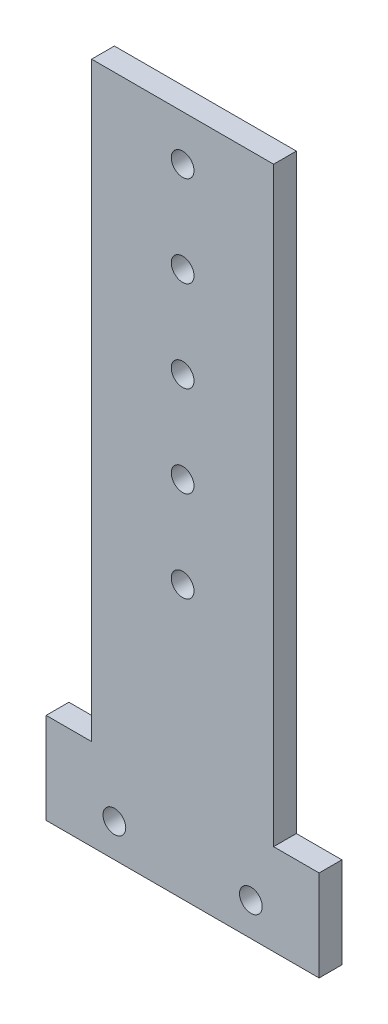
ISO-10303-21;
HEADER;
FILE_DESCRIPTION(('STEP AP214'),'2;1');
FILE_NAME('part.step','',(''),(''),'','','');
FILE_SCHEMA(('AUTOMOTIVE_DESIGN { 1 0 10303 214 1 1 1 1 }'));
ENDSEC;
DATA;
#1=APPLICATION_CONTEXT('core data for automotive mechanical design processes');
#2=APPLICATION_PROTOCOL_DEFINITION('international standard','automotive_design',2000,#1);
#3=PRODUCT_CONTEXT('',#1,'mechanical');
#4=PRODUCT('Part','Part','',(#3));
#5=PRODUCT_RELATED_PRODUCT_CATEGORY('part','',(#4));
#6=PRODUCT_DEFINITION_FORMATION('','',#4);
#7=PRODUCT_DEFINITION_CONTEXT('part definition',#1,'design');
#8=PRODUCT_DEFINITION('design','',#6,#7);
#9=PRODUCT_DEFINITION_SHAPE('','',#8);
#10=(LENGTH_UNIT() NAMED_UNIT(*) SI_UNIT(.MILLI.,.METRE.));
#11=(NAMED_UNIT(*) PLANE_ANGLE_UNIT() SI_UNIT($,.RADIAN.));
#12=(NAMED_UNIT(*) SI_UNIT($,.STERADIAN.) SOLID_ANGLE_UNIT());
#13=UNCERTAINTY_MEASURE_WITH_UNIT(LENGTH_MEASURE(1.E-05),#10,'distance_accuracy_value','');
#14=(GEOMETRIC_REPRESENTATION_CONTEXT(3) GLOBAL_UNCERTAINTY_ASSIGNED_CONTEXT((#13)) GLOBAL_UNIT_ASSIGNED_CONTEXT((#10,
#11,#12)) REPRESENTATION_CONTEXT('',''));
#15=CARTESIAN_POINT('',(0.,0.,0.));
#16=DIRECTION('',(0.,0.,1.));
#17=DIRECTION('',(1.,0.,0.));
#18=AXIS2_PLACEMENT_3D('',#15,#16,#17);
#19=CARTESIAN_POINT('',(0.,0.,6.35));
#20=DIRECTION('',(0.,0.,-1.));
#21=DIRECTION('',(-1.,0.,0.));
#22=AXIS2_PLACEMENT_3D('',#19,#20,#21);
#23=PLANE('',#22);
#24=DIRECTION('',(-1.,0.,0.));
#25=VECTOR('',#24,1.);
#26=CARTESIAN_POINT('',(50.8,178.506188544528,6.35));
#27=LINE('',#26,#25);
#28=CARTESIAN_POINT('',(50.8,178.506188544528,6.35));
#29=VERTEX_POINT('',#28);
#30=CARTESIAN_POINT('',(0.,178.506188544528,6.35));
#31=VERTEX_POINT('',#30);
#32=EDGE_CURVE('E145',#29,#31,#27,.T.);
#33=ORIENTED_EDGE('',*,*,#32,.T.);
#34=DIRECTION('',(0.,-1.,0.));
#35=VECTOR('',#34,1.);
#36=CARTESIAN_POINT('',(0.,13.5061885445277,6.35));
#37=LINE('',#36,#35);
#38=CARTESIAN_POINT('',(0.,13.5061885445277,6.35));
#39=VERTEX_POINT('',#38);
#40=EDGE_CURVE('E93',#31,#39,#37,.T.);
#41=ORIENTED_EDGE('',*,*,#40,.T.);
#42=DIRECTION('',(-1.,0.,0.));
#43=VECTOR('',#42,1.);
#44=CARTESIAN_POINT('',(0.,13.5061885445277,6.35));
#45=LINE('',#44,#43);
#46=CARTESIAN_POINT('',(-12.7,13.5061885445277,6.35));
#47=VERTEX_POINT('',#46);
#48=EDGE_CURVE('E160',#39,#47,#45,.T.);
#49=ORIENTED_EDGE('',*,*,#48,.T.);
#50=DIRECTION('',(0.,-1.,0.));
#51=VECTOR('',#50,1.);
#52=CARTESIAN_POINT('',(-12.7,13.5061885445277,6.35));
#53=LINE('',#52,#51);
#54=CARTESIAN_POINT('',(-12.7,-11.8938114554723,6.35));
#55=VERTEX_POINT('',#54);
#56=EDGE_CURVE('E173',#47,#55,#53,.T.);
#57=ORIENTED_EDGE('',*,*,#56,.T.);
#58=DIRECTION('',(1.,0.,0.));
#59=VECTOR('',#58,1.);
#60=CARTESIAN_POINT('',(63.5,-11.8938114554723,6.35));
#61=LINE('',#60,#59);
#62=CARTESIAN_POINT('',(63.5,-11.8938114554723,6.35));
#63=VERTEX_POINT('',#62);
#64=EDGE_CURVE('E112',#55,#63,#61,.T.);
#65=ORIENTED_EDGE('',*,*,#64,.T.);
#66=DIRECTION('',(0.,1.,0.));
#67=VECTOR('',#66,1.);
#68=CARTESIAN_POINT('',(63.5,13.5061885445277,6.35));
#69=LINE('',#68,#67);
#70=CARTESIAN_POINT('',(63.5,13.5061885445277,6.35));
#71=VERTEX_POINT('',#70);
#72=EDGE_CURVE('E106',#63,#71,#69,.T.);
#73=ORIENTED_EDGE('',*,*,#72,.T.);
#74=DIRECTION('',(-1.,0.,0.));
#75=VECTOR('',#74,1.);
#76=CARTESIAN_POINT('',(63.5,13.5061885445277,6.35));
#77=LINE('',#76,#75);
#78=CARTESIAN_POINT('',(50.8,13.5061885445277,6.35));
#79=VERTEX_POINT('',#78);
#80=EDGE_CURVE('E110',#71,#79,#77,.T.);
#81=ORIENTED_EDGE('',*,*,#80,.T.);
#82=DIRECTION('',(0.,1.,0.));
#83=VECTOR('',#82,1.);
#84=CARTESIAN_POINT('',(50.8,13.5061885445277,6.35));
#85=LINE('',#84,#83);
#86=EDGE_CURVE('E50',#79,#29,#85,.T.);
#87=ORIENTED_EDGE('',*,*,#86,.T.);
#88=EDGE_LOOP('',(#33,#41,#49,#57,#65,#73,#81,#87));
#89=FACE_BOUND('',#88,.T.);
#90=CARTESIAN_POINT('',(6.35,-2.60484772527531,6.35));
#91=DIRECTION('',(0.,0.,1.));
#92=DIRECTION('',(1.,0.,0.));
#93=AXIS2_PLACEMENT_3D('',#90,#91,#92);
#94=CIRCLE('',#93,3.175);
#95=CARTESIAN_POINT('',(9.525,-2.60484772527531,6.35));
#96=VERTEX_POINT('',#95);
#97=EDGE_CURVE('E134',#96,#96,#94,.T.);
#98=ORIENTED_EDGE('',*,*,#97,.F.);
#99=EDGE_LOOP('',(#98));
#100=FACE_BOUND('',#99,.T.);
#101=CARTESIAN_POINT('',(44.45,-2.60484772527531,6.35));
#102=DIRECTION('',(0.,0.,1.));
#103=DIRECTION('',(1.,0.,0.));
#104=AXIS2_PLACEMENT_3D('',#101,#102,#103);
#105=CIRCLE('',#104,3.175);
#106=CARTESIAN_POINT('',(47.625,-2.60484772527531,6.35));
#107=VERTEX_POINT('',#106);
#108=EDGE_CURVE('E182',#107,#107,#105,.T.);
#109=ORIENTED_EDGE('',*,*,#108,.F.);
#110=EDGE_LOOP('',(#109));
#111=FACE_BOUND('',#110,.T.);
#112=CARTESIAN_POINT('',(25.4,165.806188544528,6.35));
#113=DIRECTION('',(0.,0.,1.));
#114=DIRECTION('',(1.,0.,0.));
#115=AXIS2_PLACEMENT_3D('',#112,#113,#114);
#116=CIRCLE('',#115,3.175);
#117=CARTESIAN_POINT('',(28.575,165.806188544528,6.35));
#118=VERTEX_POINT('',#117);
#119=EDGE_CURVE('E188',#118,#118,#116,.T.);
#120=ORIENTED_EDGE('',*,*,#119,.F.);
#121=EDGE_LOOP('',(#120));
#122=FACE_BOUND('',#121,.T.);
#123=CARTESIAN_POINT('',(25.4,140.406188544528,6.35));
#124=DIRECTION('',(0.,0.,1.));
#125=DIRECTION('',(1.,0.,0.));
#126=AXIS2_PLACEMENT_3D('',#123,#124,#125);
#127=CIRCLE('',#126,3.175);
#128=CARTESIAN_POINT('',(28.575,140.406188544528,6.35));
#129=VERTEX_POINT('',#128);
#130=EDGE_CURVE('E194',#129,#129,#127,.T.);
#131=ORIENTED_EDGE('',*,*,#130,.F.);
#132=EDGE_LOOP('',(#131));
#133=FACE_BOUND('',#132,.T.);
#134=CARTESIAN_POINT('',(25.4,115.006188544528,6.35));
#135=DIRECTION('',(0.,0.,1.));
#136=DIRECTION('',(1.,0.,0.));
#137=AXIS2_PLACEMENT_3D('',#134,#135,#136);
#138=CIRCLE('',#137,3.175);
#139=CARTESIAN_POINT('',(28.575,115.006188544528,6.35));
#140=VERTEX_POINT('',#139);
#141=EDGE_CURVE('E200',#140,#140,#138,.T.);
#142=ORIENTED_EDGE('',*,*,#141,.F.);
#143=EDGE_LOOP('',(#142));
#144=FACE_BOUND('',#143,.T.);
#145=CARTESIAN_POINT('',(25.4,89.6061885445277,6.35));
#146=DIRECTION('',(0.,0.,1.));
#147=DIRECTION('',(1.,0.,0.));
#148=AXIS2_PLACEMENT_3D('',#145,#146,#147);
#149=CIRCLE('',#148,3.175);
#150=CARTESIAN_POINT('',(28.575,89.6061885445277,6.35));
#151=VERTEX_POINT('',#150);
#152=EDGE_CURVE('E206',#151,#151,#149,.T.);
#153=ORIENTED_EDGE('',*,*,#152,.F.);
#154=EDGE_LOOP('',(#153));
#155=FACE_BOUND('',#154,.T.);
#156=CARTESIAN_POINT('',(25.4,64.2061885445277,6.35));
#157=DIRECTION('',(0.,0.,1.));
#158=DIRECTION('',(1.,0.,0.));
#159=AXIS2_PLACEMENT_3D('',#156,#157,#158);
#160=CIRCLE('',#159,3.175);
#161=CARTESIAN_POINT('',(28.575,64.2061885445277,6.35));
#162=VERTEX_POINT('',#161);
#163=EDGE_CURVE('E212',#162,#162,#160,.T.);
#164=ORIENTED_EDGE('',*,*,#163,.F.);
#165=EDGE_LOOP('',(#164));
#166=FACE_BOUND('',#165,.T.);
#167=ADVANCED_FACE('F33',(#89,#100,#111,#122,#133,#144,#155,#166),#23,.F.);
#168=CARTESIAN_POINT('',(0.,0.,0.));
#169=DIRECTION('',(0.,0.,-1.));
#170=DIRECTION('',(-1.,0.,0.));
#171=AXIS2_PLACEMENT_3D('',#168,#169,#170);
#172=PLANE('',#171);
#173=CARTESIAN_POINT('',(25.4,89.6061885445277,0.));
#174=DIRECTION('',(0.,0.,1.));
#175=DIRECTION('',(1.,0.,0.));
#176=AXIS2_PLACEMENT_3D('',#173,#174,#175);
#177=CIRCLE('',#176,3.175);
#178=CARTESIAN_POINT('',(28.575,89.6061885445277,0.));
#179=VERTEX_POINT('',#178);
#180=EDGE_CURVE('E209',#179,#179,#177,.T.);
#181=ORIENTED_EDGE('',*,*,#180,.T.);
#182=EDGE_LOOP('',(#181));
#183=FACE_BOUND('',#182,.T.);
#184=CARTESIAN_POINT('',(25.4,140.406188544528,0.));
#185=DIRECTION('',(0.,0.,1.));
#186=DIRECTION('',(1.,0.,0.));
#187=AXIS2_PLACEMENT_3D('',#184,#185,#186);
#188=CIRCLE('',#187,3.175);
#189=CARTESIAN_POINT('',(28.575,140.406188544528,0.));
#190=VERTEX_POINT('',#189);
#191=EDGE_CURVE('E197',#190,#190,#188,.T.);
#192=ORIENTED_EDGE('',*,*,#191,.T.);
#193=EDGE_LOOP('',(#192));
#194=FACE_BOUND('',#193,.T.);
#195=CARTESIAN_POINT('',(44.45,-2.60484772527531,0.));
#196=DIRECTION('',(0.,0.,1.));
#197=DIRECTION('',(1.,0.,0.));
#198=AXIS2_PLACEMENT_3D('',#195,#196,#197);
#199=CIRCLE('',#198,3.175);
#200=CARTESIAN_POINT('',(47.625,-2.60484772527531,0.));
#201=VERTEX_POINT('',#200);
#202=EDGE_CURVE('E185',#201,#201,#199,.T.);
#203=ORIENTED_EDGE('',*,*,#202,.T.);
#204=EDGE_LOOP('',(#203));
#205=FACE_BOUND('',#204,.T.);
#206=DIRECTION('',(-1.,0.,0.));
#207=VECTOR('',#206,1.);
#208=CARTESIAN_POINT('',(50.8,178.506188544528,0.));
#209=LINE('',#208,#207);
#210=CARTESIAN_POINT('',(50.8,178.506188544528,0.));
#211=VERTEX_POINT('',#210);
#212=CARTESIAN_POINT('',(0.,178.506188544528,0.));
#213=VERTEX_POINT('',#212);
#214=EDGE_CURVE('E130',#211,#213,#209,.T.);
#215=ORIENTED_EDGE('',*,*,#214,.F.);
#216=DIRECTION('',(0.,1.,0.));
#217=VECTOR('',#216,1.);
#218=CARTESIAN_POINT('',(50.8,13.5061885445277,0.));
#219=LINE('',#218,#217);
#220=CARTESIAN_POINT('',(50.8,13.5061885445277,0.));
#221=VERTEX_POINT('',#220);
#222=EDGE_CURVE('E85',#221,#211,#219,.T.);
#223=ORIENTED_EDGE('',*,*,#222,.F.);
#224=DIRECTION('',(-1.,0.,0.));
#225=VECTOR('',#224,1.);
#226=CARTESIAN_POINT('',(63.5,13.5061885445277,0.));
#227=LINE('',#226,#225);
#228=CARTESIAN_POINT('',(63.5,13.5061885445277,0.));
#229=VERTEX_POINT('',#228);
#230=EDGE_CURVE('E79',#229,#221,#227,.T.);
#231=ORIENTED_EDGE('',*,*,#230,.F.);
#232=DIRECTION('',(0.,1.,0.));
#233=VECTOR('',#232,1.);
#234=CARTESIAN_POINT('',(63.5,13.5061885445277,0.));
#235=LINE('',#234,#233);
#236=CARTESIAN_POINT('',(63.5,-11.8938114554723,0.));
#237=VERTEX_POINT('',#236);
#238=EDGE_CURVE('E120',#237,#229,#235,.T.);
#239=ORIENTED_EDGE('',*,*,#238,.F.);
#240=DIRECTION('',(1.,0.,0.));
#241=VECTOR('',#240,1.);
#242=CARTESIAN_POINT('',(63.5,-11.8938114554723,0.));
#243=LINE('',#242,#241);
#244=CARTESIAN_POINT('',(-12.7,-11.8938114554723,0.));
#245=VERTEX_POINT('',#244);
#246=EDGE_CURVE('E140',#245,#237,#243,.T.);
#247=ORIENTED_EDGE('',*,*,#246,.F.);
#248=DIRECTION('',(0.,-1.,0.));
#249=VECTOR('',#248,1.);
#250=CARTESIAN_POINT('',(-12.7,13.5061885445277,0.));
#251=LINE('',#250,#249);
#252=CARTESIAN_POINT('',(-12.7,13.5061885445277,0.));
#253=VERTEX_POINT('',#252);
#254=EDGE_CURVE('E138',#253,#245,#251,.T.);
#255=ORIENTED_EDGE('',*,*,#254,.F.);
#256=DIRECTION('',(-1.,0.,0.));
#257=VECTOR('',#256,1.);
#258=CARTESIAN_POINT('',(0.,13.5061885445277,0.));
#259=LINE('',#258,#257);
#260=CARTESIAN_POINT('',(0.,13.5061885445277,0.));
#261=VERTEX_POINT('',#260);
#262=EDGE_CURVE('E136',#261,#253,#259,.T.);
#263=ORIENTED_EDGE('',*,*,#262,.F.);
#264=DIRECTION('',(0.,-1.,0.));
#265=VECTOR('',#264,1.);
#266=CARTESIAN_POINT('',(0.,13.5061885445277,0.));
#267=LINE('',#266,#265);
#268=EDGE_CURVE('E133',#213,#261,#267,.T.);
#269=ORIENTED_EDGE('',*,*,#268,.F.);
#270=EDGE_LOOP('',(#215,#223,#231,#239,#247,#255,#263,#269));
#271=FACE_BOUND('',#270,.T.);
#272=CARTESIAN_POINT('',(6.35,-2.60484772527531,0.));
#273=DIRECTION('',(0.,0.,1.));
#274=DIRECTION('',(1.,0.,0.));
#275=AXIS2_PLACEMENT_3D('',#272,#273,#274);
#276=CIRCLE('',#275,3.175);
#277=CARTESIAN_POINT('',(9.525,-2.60484772527531,0.));
#278=VERTEX_POINT('',#277);
#279=EDGE_CURVE('E179',#278,#278,#276,.T.);
#280=ORIENTED_EDGE('',*,*,#279,.T.);
#281=EDGE_LOOP('',(#280));
#282=FACE_BOUND('',#281,.T.);
#283=CARTESIAN_POINT('',(25.4,165.806188544528,0.));
#284=DIRECTION('',(0.,0.,1.));
#285=DIRECTION('',(1.,0.,0.));
#286=AXIS2_PLACEMENT_3D('',#283,#284,#285);
#287=CIRCLE('',#286,3.175);
#288=CARTESIAN_POINT('',(28.575,165.806188544528,0.));
#289=VERTEX_POINT('',#288);
#290=EDGE_CURVE('E191',#289,#289,#287,.T.);
#291=ORIENTED_EDGE('',*,*,#290,.T.);
#292=EDGE_LOOP('',(#291));
#293=FACE_BOUND('',#292,.T.);
#294=CARTESIAN_POINT('',(25.4,115.006188544528,0.));
#295=DIRECTION('',(0.,0.,1.));
#296=DIRECTION('',(1.,0.,0.));
#297=AXIS2_PLACEMENT_3D('',#294,#295,#296);
#298=CIRCLE('',#297,3.175);
#299=CARTESIAN_POINT('',(28.575,115.006188544528,0.));
#300=VERTEX_POINT('',#299);
#301=EDGE_CURVE('E203',#300,#300,#298,.T.);
#302=ORIENTED_EDGE('',*,*,#301,.T.);
#303=EDGE_LOOP('',(#302));
#304=FACE_BOUND('',#303,.T.);
#305=CARTESIAN_POINT('',(25.4,64.2061885445277,0.));
#306=DIRECTION('',(0.,0.,1.));
#307=DIRECTION('',(1.,0.,0.));
#308=AXIS2_PLACEMENT_3D('',#305,#306,#307);
#309=CIRCLE('',#308,3.175);
#310=CARTESIAN_POINT('',(28.575,64.2061885445277,0.));
#311=VERTEX_POINT('',#310);
#312=EDGE_CURVE('E215',#311,#311,#309,.T.);
#313=ORIENTED_EDGE('',*,*,#312,.T.);
#314=EDGE_LOOP('',(#313));
#315=FACE_BOUND('',#314,.T.);
#316=ADVANCED_FACE('F164',(#183,#194,#205,#271,#282,#293,#304,#315),#172,.T.);
#317=CARTESIAN_POINT('',(50.8,178.506188544528,6.35));
#318=DIRECTION('',(0.,-1.,0.));
#319=DIRECTION('',(0.,0.,-1.));
#320=AXIS2_PLACEMENT_3D('',#317,#318,#319);
#321=PLANE('',#320);
#322=ORIENTED_EDGE('',*,*,#214,.T.);
#323=DIRECTION('',(0.,0.,-1.));
#324=VECTOR('',#323,1.);
#325=CARTESIAN_POINT('',(0.,178.506188544528,6.35));
#326=LINE('',#325,#324);
#327=EDGE_CURVE('E11',#31,#213,#326,.T.);
#328=ORIENTED_EDGE('',*,*,#327,.F.);
#329=ORIENTED_EDGE('',*,*,#32,.F.);
#330=DIRECTION('',(0.,0.,-1.));
#331=VECTOR('',#330,1.);
#332=CARTESIAN_POINT('',(50.8,178.506188544528,6.35));
#333=LINE('',#332,#331);
#334=EDGE_CURVE('E126',#29,#211,#333,.T.);
#335=ORIENTED_EDGE('',*,*,#334,.T.);
#336=EDGE_LOOP('',(#322,#328,#329,#335));
#337=FACE_BOUND('',#336,.T.);
#338=ADVANCED_FACE('F35',(#337),#321,.F.);
#339=CARTESIAN_POINT('',(0.,13.5061885445277,6.35));
#340=DIRECTION('',(1.,0.,0.));
#341=DIRECTION('',(0.,1.,0.));
#342=AXIS2_PLACEMENT_3D('',#339,#340,#341);
#343=PLANE('',#342);
#344=ORIENTED_EDGE('',*,*,#268,.T.);
#345=DIRECTION('',(0.,0.,-1.));
#346=VECTOR('',#345,1.);
#347=CARTESIAN_POINT('',(0.,13.5061885445277,6.35));
#348=LINE('',#347,#346);
#349=EDGE_CURVE('E42',#39,#261,#348,.T.);
#350=ORIENTED_EDGE('',*,*,#349,.F.);
#351=ORIENTED_EDGE('',*,*,#40,.F.);
#352=ORIENTED_EDGE('',*,*,#327,.T.);
#353=EDGE_LOOP('',(#344,#350,#351,#352));
#354=FACE_BOUND('',#353,.T.);
#355=ADVANCED_FACE('F247',(#354),#343,.F.);
#356=CARTESIAN_POINT('',(0.,13.5061885445277,6.35));
#357=DIRECTION('',(0.,-1.,0.));
#358=DIRECTION('',(0.,0.,-1.));
#359=AXIS2_PLACEMENT_3D('',#356,#357,#358);
#360=PLANE('',#359);
#361=ORIENTED_EDGE('',*,*,#262,.T.);
#362=DIRECTION('',(0.,0.,-1.));
#363=VECTOR('',#362,1.);
#364=CARTESIAN_POINT('',(-12.7,13.5061885445277,6.35));
#365=LINE('',#364,#363);
#366=EDGE_CURVE('E152',#47,#253,#365,.T.);
#367=ORIENTED_EDGE('',*,*,#366,.F.);
#368=ORIENTED_EDGE('',*,*,#48,.F.);
#369=ORIENTED_EDGE('',*,*,#349,.T.);
#370=EDGE_LOOP('',(#361,#367,#368,#369));
#371=FACE_BOUND('',#370,.T.);
#372=ADVANCED_FACE('F158',(#371),#360,.F.);
#373=CARTESIAN_POINT('',(-12.7,13.5061885445277,6.35));
#374=DIRECTION('',(1.,0.,0.));
#375=DIRECTION('',(0.,1.,0.));
#376=AXIS2_PLACEMENT_3D('',#373,#374,#375);
#377=PLANE('',#376);
#378=ORIENTED_EDGE('',*,*,#254,.T.);
#379=DIRECTION('',(0.,0.,-1.));
#380=VECTOR('',#379,1.);
#381=CARTESIAN_POINT('',(-12.7,-11.8938114554723,6.35));
#382=LINE('',#381,#380);
#383=EDGE_CURVE('E149',#55,#245,#382,.T.);
#384=ORIENTED_EDGE('',*,*,#383,.F.);
#385=ORIENTED_EDGE('',*,*,#56,.F.);
#386=ORIENTED_EDGE('',*,*,#366,.T.);
#387=EDGE_LOOP('',(#378,#384,#385,#386));
#388=FACE_BOUND('',#387,.T.);
#389=ADVANCED_FACE('F169',(#388),#377,.F.);
#390=CARTESIAN_POINT('',(63.5,-11.8938114554723,6.35));
#391=DIRECTION('',(0.,1.,0.));
#392=DIRECTION('',(-1.,0.,0.));
#393=AXIS2_PLACEMENT_3D('',#390,#391,#392);
#394=PLANE('',#393);
#395=ORIENTED_EDGE('',*,*,#246,.T.);
#396=DIRECTION('',(0.,0.,-1.));
#397=VECTOR('',#396,1.);
#398=CARTESIAN_POINT('',(63.5,-11.8938114554723,6.35));
#399=LINE('',#398,#397);
#400=EDGE_CURVE('E121',#63,#237,#399,.T.);
#401=ORIENTED_EDGE('',*,*,#400,.F.);
#402=ORIENTED_EDGE('',*,*,#64,.F.);
#403=ORIENTED_EDGE('',*,*,#383,.T.);
#404=EDGE_LOOP('',(#395,#401,#402,#403));
#405=FACE_BOUND('',#404,.T.);
#406=ADVANCED_FACE('F172',(#405),#394,.F.);
#407=CARTESIAN_POINT('',(63.5,13.5061885445277,6.35));
#408=DIRECTION('',(-1.,0.,0.));
#409=DIRECTION('',(0.,0.,1.));
#410=AXIS2_PLACEMENT_3D('',#407,#408,#409);
#411=PLANE('',#410);
#412=ORIENTED_EDGE('',*,*,#238,.T.);
#413=DIRECTION('',(0.,0.,-1.));
#414=VECTOR('',#413,1.);
#415=CARTESIAN_POINT('',(63.5,13.5061885445277,6.35));
#416=LINE('',#415,#414);
#417=EDGE_CURVE('E117',#71,#229,#416,.T.);
#418=ORIENTED_EDGE('',*,*,#417,.F.);
#419=ORIENTED_EDGE('',*,*,#72,.F.);
#420=ORIENTED_EDGE('',*,*,#400,.T.);
#421=EDGE_LOOP('',(#412,#418,#419,#420));
#422=FACE_BOUND('',#421,.T.);
#423=ADVANCED_FACE('F118',(#422),#411,.F.);
#424=CARTESIAN_POINT('',(63.5,13.5061885445277,6.35));
#425=DIRECTION('',(0.,-1.,0.));
#426=DIRECTION('',(1.,0.,0.));
#427=AXIS2_PLACEMENT_3D('',#424,#425,#426);
#428=PLANE('',#427);
#429=ORIENTED_EDGE('',*,*,#230,.T.);
#430=DIRECTION('',(0.,0.,-1.));
#431=VECTOR('',#430,1.);
#432=CARTESIAN_POINT('',(50.8,13.5061885445277,6.35));
#433=LINE('',#432,#431);
#434=EDGE_CURVE('E122',#79,#221,#433,.T.);
#435=ORIENTED_EDGE('',*,*,#434,.F.);
#436=ORIENTED_EDGE('',*,*,#80,.F.);
#437=ORIENTED_EDGE('',*,*,#417,.T.);
#438=EDGE_LOOP('',(#429,#435,#436,#437));
#439=FACE_BOUND('',#438,.T.);
#440=ADVANCED_FACE('F124',(#439),#428,.F.);
#441=CARTESIAN_POINT('',(50.8,13.5061885445277,6.35));
#442=DIRECTION('',(-1.,0.,0.));
#443=DIRECTION('',(0.,0.,1.));
#444=AXIS2_PLACEMENT_3D('',#441,#442,#443);
#445=PLANE('',#444);
#446=ORIENTED_EDGE('',*,*,#222,.T.);
#447=ORIENTED_EDGE('',*,*,#334,.F.);
#448=ORIENTED_EDGE('',*,*,#86,.F.);
#449=ORIENTED_EDGE('',*,*,#434,.T.);
#450=EDGE_LOOP('',(#446,#447,#448,#449));
#451=FACE_BOUND('',#450,.T.);
#452=ADVANCED_FACE('F235',(#451),#445,.F.);
#453=CARTESIAN_POINT('',(6.35,-2.60484772527531,6.35));
#454=DIRECTION('',(0.,0.,-1.));
#455=DIRECTION('',(-1.,0.,0.));
#456=AXIS2_PLACEMENT_3D('',#453,#454,#455);
#457=CYLINDRICAL_SURFACE('',#456,3.175);
#458=ORIENTED_EDGE('',*,*,#97,.T.);
#459=EDGE_LOOP('',(#458));
#460=FACE_BOUND('',#459,.T.);
#461=ORIENTED_EDGE('',*,*,#279,.F.);
#462=EDGE_LOOP('',(#461));
#463=FACE_BOUND('',#462,.T.);
#464=ADVANCED_FACE('F232',(#460,#463),#457,.F.);
#465=CARTESIAN_POINT('',(44.45,-2.60484772527531,6.35));
#466=DIRECTION('',(0.,0.,-1.));
#467=DIRECTION('',(-1.,0.,0.));
#468=AXIS2_PLACEMENT_3D('',#465,#466,#467);
#469=CYLINDRICAL_SURFACE('',#468,3.175);
#470=ORIENTED_EDGE('',*,*,#108,.T.);
#471=EDGE_LOOP('',(#470));
#472=FACE_BOUND('',#471,.T.);
#473=ORIENTED_EDGE('',*,*,#202,.F.);
#474=EDGE_LOOP('',(#473));
#475=FACE_BOUND('',#474,.T.);
#476=ADVANCED_FACE('F311',(#472,#475),#469,.F.);
#477=CARTESIAN_POINT('',(25.4,165.806188544528,6.35));
#478=DIRECTION('',(0.,0.,-1.));
#479=DIRECTION('',(-1.,0.,0.));
#480=AXIS2_PLACEMENT_3D('',#477,#478,#479);
#481=CYLINDRICAL_SURFACE('',#480,3.175);
#482=ORIENTED_EDGE('',*,*,#119,.T.);
#483=EDGE_LOOP('',(#482));
#484=FACE_BOUND('',#483,.T.);
#485=ORIENTED_EDGE('',*,*,#290,.F.);
#486=EDGE_LOOP('',(#485));
#487=FACE_BOUND('',#486,.T.);
#488=ADVANCED_FACE('F319',(#484,#487),#481,.F.);
#489=CARTESIAN_POINT('',(25.4,140.406188544528,6.35));
#490=DIRECTION('',(0.,0.,-1.));
#491=DIRECTION('',(-1.,0.,0.));
#492=AXIS2_PLACEMENT_3D('',#489,#490,#491);
#493=CYLINDRICAL_SURFACE('',#492,3.175);
#494=ORIENTED_EDGE('',*,*,#130,.T.);
#495=EDGE_LOOP('',(#494));
#496=FACE_BOUND('',#495,.T.);
#497=ORIENTED_EDGE('',*,*,#191,.F.);
#498=EDGE_LOOP('',(#497));
#499=FACE_BOUND('',#498,.T.);
#500=ADVANCED_FACE('F327',(#496,#499),#493,.F.);
#501=CARTESIAN_POINT('',(25.4,115.006188544528,6.35));
#502=DIRECTION('',(0.,0.,-1.));
#503=DIRECTION('',(-1.,0.,0.));
#504=AXIS2_PLACEMENT_3D('',#501,#502,#503);
#505=CYLINDRICAL_SURFACE('',#504,3.175);
#506=ORIENTED_EDGE('',*,*,#141,.T.);
#507=EDGE_LOOP('',(#506));
#508=FACE_BOUND('',#507,.T.);
#509=ORIENTED_EDGE('',*,*,#301,.F.);
#510=EDGE_LOOP('',(#509));
#511=FACE_BOUND('',#510,.T.);
#512=ADVANCED_FACE('F336',(#508,#511),#505,.F.);
#513=CARTESIAN_POINT('',(25.4,89.6061885445277,6.35));
#514=DIRECTION('',(0.,0.,-1.));
#515=DIRECTION('',(-1.,0.,0.));
#516=AXIS2_PLACEMENT_3D('',#513,#514,#515);
#517=CYLINDRICAL_SURFACE('',#516,3.175);
#518=ORIENTED_EDGE('',*,*,#152,.T.);
#519=EDGE_LOOP('',(#518));
#520=FACE_BOUND('',#519,.T.);
#521=ORIENTED_EDGE('',*,*,#180,.F.);
#522=EDGE_LOOP('',(#521));
#523=FACE_BOUND('',#522,.T.);
#524=ADVANCED_FACE('F345',(#520,#523),#517,.F.);
#525=CARTESIAN_POINT('',(25.4,64.2061885445277,6.35));
#526=DIRECTION('',(0.,0.,-1.));
#527=DIRECTION('',(-1.,0.,0.));
#528=AXIS2_PLACEMENT_3D('',#525,#526,#527);
#529=CYLINDRICAL_SURFACE('',#528,3.175);
#530=ORIENTED_EDGE('',*,*,#163,.T.);
#531=EDGE_LOOP('',(#530));
#532=FACE_BOUND('',#531,.T.);
#533=ORIENTED_EDGE('',*,*,#312,.F.);
#534=EDGE_LOOP('',(#533));
#535=FACE_BOUND('',#534,.T.);
#536=ADVANCED_FACE('F221',(#532,#535),#529,.F.);
#537=CLOSED_SHELL('',(#167,#316,#338,#355,#372,#389,#406,#423,#440,#452,#464,#476,#488,#500,
#512,#524,#536));
#538=MANIFOLD_SOLID_BREP('B2',#537);
#539=ADVANCED_BREP_SHAPE_REPRESENTATION('',(#18,#538),#14);
#540=SHAPE_DEFINITION_REPRESENTATION(#9,#539);
ENDSEC;
END-ISO-10303-21;
